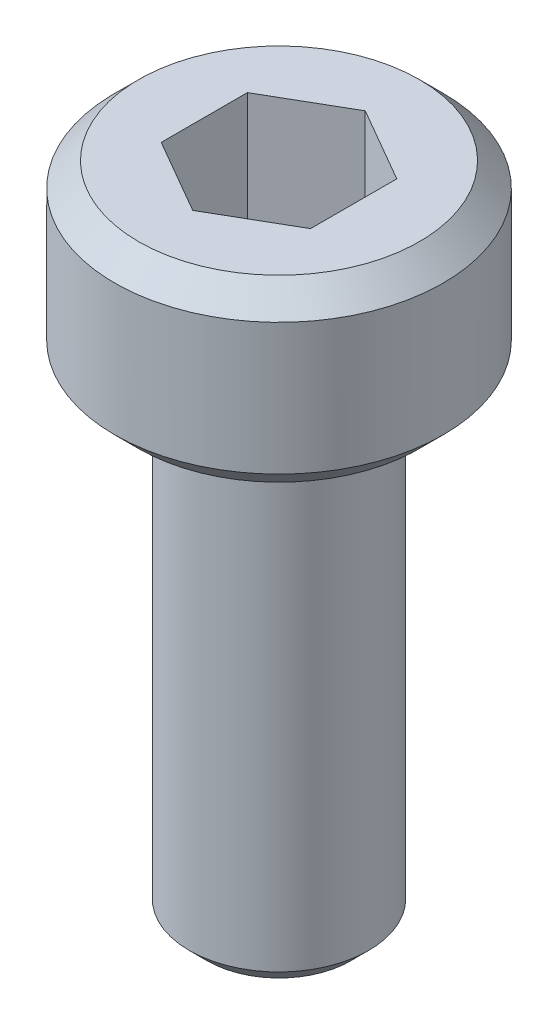
ISO-10303-21;
HEADER;
FILE_DESCRIPTION(('STEP AP214'),'2;1');
FILE_NAME('part.step','',(''),(''),'','','');
FILE_SCHEMA(('AUTOMOTIVE_DESIGN { 1 0 10303 214 1 1 1 1 }'));
ENDSEC;
DATA;
#1=APPLICATION_CONTEXT('core data for automotive mechanical design processes');
#2=APPLICATION_PROTOCOL_DEFINITION('international standard','automotive_design',2000,#1);
#3=PRODUCT_CONTEXT('',#1,'mechanical');
#4=PRODUCT('Part','Part','',(#3));
#5=PRODUCT_RELATED_PRODUCT_CATEGORY('part','',(#4));
#6=PRODUCT_DEFINITION_FORMATION('','',#4);
#7=PRODUCT_DEFINITION_CONTEXT('part definition',#1,'design');
#8=PRODUCT_DEFINITION('design','',#6,#7);
#9=PRODUCT_DEFINITION_SHAPE('','',#8);
#10=(LENGTH_UNIT() NAMED_UNIT(*) SI_UNIT(.MILLI.,.METRE.));
#11=(NAMED_UNIT(*) PLANE_ANGLE_UNIT() SI_UNIT($,.RADIAN.));
#12=(NAMED_UNIT(*) SI_UNIT($,.STERADIAN.) SOLID_ANGLE_UNIT());
#13=UNCERTAINTY_MEASURE_WITH_UNIT(LENGTH_MEASURE(1.E-05),#10,'distance_accuracy_value','');
#14=(GEOMETRIC_REPRESENTATION_CONTEXT(3) GLOBAL_UNCERTAINTY_ASSIGNED_CONTEXT((#13)) GLOBAL_UNIT_ASSIGNED_CONTEXT((#10,
#11,#12)) REPRESENTATION_CONTEXT('',''));
#15=CARTESIAN_POINT('',(0.,0.,0.));
#16=DIRECTION('',(0.,0.,1.));
#17=DIRECTION('',(1.,0.,0.));
#18=AXIS2_PLACEMENT_3D('',#15,#16,#17);
#19=CARTESIAN_POINT('',(0.,1.,-1.44337567297406));
#20=DIRECTION('',(-0.5,0.,-0.866025403784438));
#21=DIRECTION('',(-0.866025403784438,0.,0.5));
#22=AXIS2_PLACEMENT_3D('',#19,#20,#21);
#23=PLANE('',#22);
#24=DIRECTION('',(0.,1.,0.));
#25=VECTOR('',#24,1.);
#26=CARTESIAN_POINT('',(-1.25,1.,-0.721687836487031));
#27=LINE('',#26,#25);
#28=CARTESIAN_POINT('',(-1.25,3.,-0.721687836487031));
#29=VERTEX_POINT('',#28);
#30=CARTESIAN_POINT('',(-1.25,1.,-0.721687836487031));
#31=VERTEX_POINT('',#30);
#32=EDGE_CURVE('E83',#29,#31,#27,.F.);
#33=ORIENTED_EDGE('',*,*,#32,.T.);
#34=DIRECTION('',(-0.866025403784438,0.,0.5));
#35=VECTOR('',#34,1.);
#36=CARTESIAN_POINT('',(0.,1.,-1.44337567297406));
#37=LINE('',#36,#35);
#38=CARTESIAN_POINT('',(0.,1.,-1.44337567297406));
#39=VERTEX_POINT('',#38);
#40=EDGE_CURVE('E72',#39,#31,#37,.T.);
#41=ORIENTED_EDGE('',*,*,#40,.F.);
#42=DIRECTION('',(0.,1.,0.));
#43=VECTOR('',#42,1.);
#44=CARTESIAN_POINT('',(0.,1.,-1.44337567297406));
#45=LINE('',#44,#43);
#46=CARTESIAN_POINT('',(0.,3.,-1.44337567297406));
#47=VERTEX_POINT('',#46);
#48=EDGE_CURVE('E92',#39,#47,#45,.T.);
#49=ORIENTED_EDGE('',*,*,#48,.T.);
#50=DIRECTION('',(-0.866025403784438,0.,0.5));
#51=VECTOR('',#50,1.);
#52=CARTESIAN_POINT('',(0.,3.,-1.44337567297406));
#53=LINE('',#52,#51);
#54=EDGE_CURVE('E67',#29,#47,#53,.F.);
#55=ORIENTED_EDGE('',*,*,#54,.F.);
#56=EDGE_LOOP('',(#33,#41,#49,#55));
#57=FACE_BOUND('',#56,.T.);
#58=ADVANCED_FACE('F17',(#57),#23,.F.);
#59=CARTESIAN_POINT('',(-1.25,1.,-0.721687836487031));
#60=DIRECTION('',(-1.,0.,0.));
#61=DIRECTION('',(0.,0.,1.));
#62=AXIS2_PLACEMENT_3D('',#59,#60,#61);
#63=PLANE('',#62);
#64=DIRECTION('',(0.,1.,0.));
#65=VECTOR('',#64,1.);
#66=CARTESIAN_POINT('',(-1.25,1.,0.721687836487033));
#67=LINE('',#66,#65);
#68=CARTESIAN_POINT('',(-1.25,3.,0.721687836487033));
#69=VERTEX_POINT('',#68);
#70=CARTESIAN_POINT('',(-1.25,1.,0.721687836487033));
#71=VERTEX_POINT('',#70);
#72=EDGE_CURVE('E88',#69,#71,#67,.F.);
#73=ORIENTED_EDGE('',*,*,#72,.T.);
#74=DIRECTION('',(0.,0.,1.));
#75=VECTOR('',#74,1.);
#76=CARTESIAN_POINT('',(-1.25,1.,-0.721687836487031));
#77=LINE('',#76,#75);
#78=EDGE_CURVE('E76',#31,#71,#77,.T.);
#79=ORIENTED_EDGE('',*,*,#78,.F.);
#80=ORIENTED_EDGE('',*,*,#32,.F.);
#81=DIRECTION('',(0.,0.,1.));
#82=VECTOR('',#81,1.);
#83=CARTESIAN_POINT('',(-1.25,3.,-0.721687836487031));
#84=LINE('',#83,#82);
#85=EDGE_CURVE('E90',#69,#29,#84,.F.);
#86=ORIENTED_EDGE('',*,*,#85,.F.);
#87=EDGE_LOOP('',(#73,#79,#80,#86));
#88=FACE_BOUND('',#87,.T.);
#89=ADVANCED_FACE('F86',(#88),#63,.F.);
#90=CARTESIAN_POINT('',(1.25,1.,-0.721687836487032));
#91=DIRECTION('',(0.5,0.,-0.866025403784439));
#92=DIRECTION('',(-0.866025403784439,0.,-0.5));
#93=AXIS2_PLACEMENT_3D('',#90,#91,#92);
#94=PLANE('',#93);
#95=ORIENTED_EDGE('',*,*,#48,.F.);
#96=DIRECTION('',(-0.866025403784439,0.,-0.5));
#97=VECTOR('',#96,1.);
#98=CARTESIAN_POINT('',(1.25,1.,-0.721687836487032));
#99=LINE('',#98,#97);
#100=CARTESIAN_POINT('',(1.25,1.,-0.721687836487032));
#101=VERTEX_POINT('',#100);
#102=EDGE_CURVE('E79',#101,#39,#99,.T.);
#103=ORIENTED_EDGE('',*,*,#102,.F.);
#104=DIRECTION('',(0.,1.,0.));
#105=VECTOR('',#104,1.);
#106=CARTESIAN_POINT('',(1.25,1.,-0.721687836487032));
#107=LINE('',#106,#105);
#108=CARTESIAN_POINT('',(1.25,3.,-0.721687836487032));
#109=VERTEX_POINT('',#108);
#110=EDGE_CURVE('E122',#101,#109,#107,.T.);
#111=ORIENTED_EDGE('',*,*,#110,.T.);
#112=DIRECTION('',(-0.866025403784439,0.,-0.5));
#113=VECTOR('',#112,1.);
#114=CARTESIAN_POINT('',(1.25,3.,-0.721687836487032));
#115=LINE('',#114,#113);
#116=EDGE_CURVE('E134',#47,#109,#115,.F.);
#117=ORIENTED_EDGE('',*,*,#116,.F.);
#118=EDGE_LOOP('',(#95,#103,#111,#117));
#119=FACE_BOUND('',#118,.T.);
#120=ADVANCED_FACE('F137',(#119),#94,.F.);
#121=CARTESIAN_POINT('',(-1.25,1.,0.721687836487033));
#122=DIRECTION('',(-0.499999999999999,0.,0.866025403784439));
#123=DIRECTION('',(0.866025403784439,0.,0.499999999999999));
#124=AXIS2_PLACEMENT_3D('',#121,#122,#123);
#125=PLANE('',#124);
#126=DIRECTION('',(0.,1.,0.));
#127=VECTOR('',#126,1.);
#128=CARTESIAN_POINT('',(0.,1.,1.44337567297406));
#129=LINE('',#128,#127);
#130=CARTESIAN_POINT('',(0.,3.,1.44337567297406));
#131=VERTEX_POINT('',#130);
#132=CARTESIAN_POINT('',(0.,1.,1.44337567297406));
#133=VERTEX_POINT('',#132);
#134=EDGE_CURVE('E119',#131,#133,#129,.F.);
#135=ORIENTED_EDGE('',*,*,#134,.T.);
#136=DIRECTION('',(0.866025403784439,0.,0.499999999999999));
#137=VECTOR('',#136,1.);
#138=CARTESIAN_POINT('',(-1.25,1.,0.721687836487033));
#139=LINE('',#138,#137);
#140=EDGE_CURVE('E128',#71,#133,#139,.T.);
#141=ORIENTED_EDGE('',*,*,#140,.F.);
#142=ORIENTED_EDGE('',*,*,#72,.F.);
#143=DIRECTION('',(0.866025403784439,0.,0.499999999999999));
#144=VECTOR('',#143,1.);
#145=CARTESIAN_POINT('',(-1.25,3.,0.721687836487033));
#146=LINE('',#145,#144);
#147=EDGE_CURVE('E130',#131,#69,#146,.F.);
#148=ORIENTED_EDGE('',*,*,#147,.F.);
#149=EDGE_LOOP('',(#135,#141,#142,#148));
#150=FACE_BOUND('',#149,.T.);
#151=ADVANCED_FACE('F144',(#150),#125,.F.);
#152=CARTESIAN_POINT('',(1.25,1.,2.1650635094611));
#153=DIRECTION('',(0.,1.,0.));
#154=DIRECTION('',(0.,0.,1.));
#155=AXIS2_PLACEMENT_3D('',#152,#153,#154);
#156=PLANE('',#155);
#157=ORIENTED_EDGE('',*,*,#40,.T.);
#158=ORIENTED_EDGE('',*,*,#78,.T.);
#159=ORIENTED_EDGE('',*,*,#140,.T.);
#160=DIRECTION('',(0.866025403784438,0.,-0.5));
#161=VECTOR('',#160,1.);
#162=CARTESIAN_POINT('',(0.,1.,1.44337567297406));
#163=LINE('',#162,#161);
#164=CARTESIAN_POINT('',(1.25,1.,0.721687836487031));
#165=VERTEX_POINT('',#164);
#166=EDGE_CURVE('E117',#133,#165,#163,.T.);
#167=ORIENTED_EDGE('',*,*,#166,.T.);
#168=DIRECTION('',(0.,0.,-1.));
#169=VECTOR('',#168,1.);
#170=CARTESIAN_POINT('',(1.25,1.,0.721687836487031));
#171=LINE('',#170,#169);
#172=EDGE_CURVE('E125',#165,#101,#171,.T.);
#173=ORIENTED_EDGE('',*,*,#172,.T.);
#174=ORIENTED_EDGE('',*,*,#102,.T.);
#175=EDGE_LOOP('',(#157,#158,#159,#167,#173,#174));
#176=FACE_BOUND('',#175,.T.);
#177=ADVANCED_FACE('F73',(#176),#156,.T.);
#178=CARTESIAN_POINT('',(1.25,1.,0.721687836487031));
#179=DIRECTION('',(1.,0.,0.));
#180=DIRECTION('',(0.,0.,-1.));
#181=AXIS2_PLACEMENT_3D('',#178,#179,#180);
#182=PLANE('',#181);
#183=ORIENTED_EDGE('',*,*,#110,.F.);
#184=ORIENTED_EDGE('',*,*,#172,.F.);
#185=DIRECTION('',(0.,1.,0.));
#186=VECTOR('',#185,1.);
#187=CARTESIAN_POINT('',(1.25,1.,0.721687836487031));
#188=LINE('',#187,#186);
#189=CARTESIAN_POINT('',(1.25,3.,0.721687836487031));
#190=VERTEX_POINT('',#189);
#191=EDGE_CURVE('E115',#165,#190,#188,.T.);
#192=ORIENTED_EDGE('',*,*,#191,.T.);
#193=DIRECTION('',(0.,0.,-1.));
#194=VECTOR('',#193,1.);
#195=CARTESIAN_POINT('',(1.25,3.,0.721687836487031));
#196=LINE('',#195,#194);
#197=EDGE_CURVE('E35',#109,#190,#196,.F.);
#198=ORIENTED_EDGE('',*,*,#197,.F.);
#199=EDGE_LOOP('',(#183,#184,#192,#198));
#200=FACE_BOUND('',#199,.T.);
#201=ADVANCED_FACE('F151',(#200),#182,.F.);
#202=CARTESIAN_POINT('',(0.,1.,1.44337567297406));
#203=DIRECTION('',(0.5,0.,0.866025403784438));
#204=DIRECTION('',(0.866025403784438,0.,-0.5));
#205=AXIS2_PLACEMENT_3D('',#202,#203,#204);
#206=PLANE('',#205);
#207=ORIENTED_EDGE('',*,*,#191,.F.);
#208=ORIENTED_EDGE('',*,*,#166,.F.);
#209=ORIENTED_EDGE('',*,*,#134,.F.);
#210=DIRECTION('',(-0.866025403784438,0.,0.500000000000001));
#211=VECTOR('',#210,1.);
#212=CARTESIAN_POINT('',(1.25,3.,0.721687836487031));
#213=LINE('',#212,#211);
#214=EDGE_CURVE('E113',#190,#131,#213,.T.);
#215=ORIENTED_EDGE('',*,*,#214,.F.);
#216=EDGE_LOOP('',(#207,#208,#209,#215));
#217=FACE_BOUND('',#216,.T.);
#218=ADVANCED_FACE('F149',(#217),#206,.F.);
#219=CARTESIAN_POINT('',(0.,3.,0.));
#220=DIRECTION('',(0.,1.,0.));
#221=DIRECTION('',(0.,0.,1.));
#222=AXIS2_PLACEMENT_3D('',#219,#220,#221);
#223=PLANE('',#222);
#224=ORIENTED_EDGE('',*,*,#197,.T.);
#225=ORIENTED_EDGE('',*,*,#214,.T.);
#226=ORIENTED_EDGE('',*,*,#147,.T.);
#227=ORIENTED_EDGE('',*,*,#85,.T.);
#228=ORIENTED_EDGE('',*,*,#54,.T.);
#229=ORIENTED_EDGE('',*,*,#116,.T.);
#230=EDGE_LOOP('',(#224,#225,#226,#227,#228,#229));
#231=FACE_BOUND('',#230,.T.);
#232=CARTESIAN_POINT('',(0.,2.9999999999859,0.));
#233=DIRECTION('',(0.,-1.,0.));
#234=DIRECTION('',(0.,0.,-1.));
#235=AXIS2_PLACEMENT_3D('',#232,#233,#234);
#236=CIRCLE('',#235,2.35000000003538);
#237=CARTESIAN_POINT('',(0.,2.9999999999859,-2.35000000003538));
#238=VERTEX_POINT('',#237);
#239=EDGE_CURVE('E20',#238,#238,#236,.T.);
#240=ORIENTED_EDGE('',*,*,#239,.F.);
#241=EDGE_LOOP('',(#240));
#242=FACE_BOUND('',#241,.T.);
#243=ADVANCED_FACE('F139',(#231,#242),#223,.T.);
#244=CARTESIAN_POINT('',(0.,2.59999999991578,0.));
#245=DIRECTION('',(0.,-1.,0.));
#246=DIRECTION('',(0.,0.,-1.));
#247=AXIS2_PLACEMENT_3D('',#244,#245,#246);
#248=CONICAL_SURFACE('',#247,2.7500000001055,0.785398163397448);
#249=ORIENTED_EDGE('',*,*,#239,.T.);
#250=EDGE_LOOP('',(#249));
#251=FACE_BOUND('',#250,.T.);
#252=CARTESIAN_POINT('',(0.,2.6,0.));
#253=DIRECTION('',(0.,-1.,0.));
#254=DIRECTION('',(0.,0.,-1.));
#255=AXIS2_PLACEMENT_3D('',#252,#253,#254);
#256=CIRCLE('',#255,2.75);
#257=CARTESIAN_POINT('',(0.,2.6,-2.75));
#258=VERTEX_POINT('',#257);
#259=EDGE_CURVE('E105',#258,#258,#256,.T.);
#260=ORIENTED_EDGE('',*,*,#259,.F.);
#261=EDGE_LOOP('',(#260));
#262=FACE_BOUND('',#261,.T.);
#263=ADVANCED_FACE('F188',(#251,#262),#248,.T.);
#264=CARTESIAN_POINT('',(0.,3.,0.));
#265=DIRECTION('',(0.,-1.,0.));
#266=DIRECTION('',(0.,0.,-1.));
#267=AXIS2_PLACEMENT_3D('',#264,#265,#266);
#268=CYLINDRICAL_SURFACE('',#267,2.75);
#269=ORIENTED_EDGE('',*,*,#259,.T.);
#270=EDGE_LOOP('',(#269));
#271=FACE_BOUND('',#270,.T.);
#272=CARTESIAN_POINT('',(0.,0.400000000013279,0.));
#273=DIRECTION('',(0.,1.,0.));
#274=DIRECTION('',(0.,0.,1.));
#275=AXIS2_PLACEMENT_3D('',#272,#273,#274);
#276=CIRCLE('',#275,2.74999999999181);
#277=CARTESIAN_POINT('',(0.,0.400000000013279,2.74999999999181));
#278=VERTEX_POINT('',#277);
#279=EDGE_CURVE('E101',#278,#278,#276,.F.);
#280=ORIENTED_EDGE('',*,*,#279,.F.);
#281=EDGE_LOOP('',(#280));
#282=FACE_BOUND('',#281,.T.);
#283=ADVANCED_FACE('F184',(#271,#282),#268,.T.);
#284=CARTESIAN_POINT('',(0.,-8.,0.));
#285=DIRECTION('',(0.,1.,0.));
#286=DIRECTION('',(0.,0.,1.));
#287=AXIS2_PLACEMENT_3D('',#284,#285,#286);
#288=PLANE('',#287);
#289=CARTESIAN_POINT('',(0.,-7.99999999998136,0.));
#290=DIRECTION('',(0.,1.,0.));
#291=DIRECTION('',(0.,0.,1.));
#292=AXIS2_PLACEMENT_3D('',#289,#290,#291);
#293=CIRCLE('',#292,1.20000000009668);
#294=CARTESIAN_POINT('',(0.,-7.99999999998136,1.20000000009668));
#295=VERTEX_POINT('',#294);
#296=EDGE_CURVE('E99',#295,#295,#293,.T.);
#297=ORIENTED_EDGE('',*,*,#296,.F.);
#298=EDGE_LOOP('',(#297));
#299=FACE_BOUND('',#298,.T.);
#300=ADVANCED_FACE('F180',(#299),#288,.F.);
#301=CARTESIAN_POINT('',(0.,0.400000000013279,0.));
#302=DIRECTION('',(0.,1.,0.));
#303=DIRECTION('',(0.,0.,1.));
#304=AXIS2_PLACEMENT_3D('',#301,#302,#303);
#305=CONICAL_SURFACE('',#304,2.74999999999181,0.785398163397448);
#306=CARTESIAN_POINT('',(0.,0.,0.));
#307=DIRECTION('',(0.,1.,0.));
#308=DIRECTION('',(0.,0.,1.));
#309=AXIS2_PLACEMENT_3D('',#306,#307,#308);
#310=CIRCLE('',#309,2.34999999997854);
#311=CARTESIAN_POINT('',(0.,0.,2.34999999997854));
#312=VERTEX_POINT('',#311);
#313=EDGE_CURVE('E97',#312,#312,#310,.T.);
#314=ORIENTED_EDGE('',*,*,#313,.T.);
#315=EDGE_LOOP('',(#314));
#316=FACE_BOUND('',#315,.T.);
#317=ORIENTED_EDGE('',*,*,#279,.T.);
#318=EDGE_LOOP('',(#317));
#319=FACE_BOUND('',#318,.T.);
#320=ADVANCED_FACE('F176',(#316,#319),#305,.T.);
#321=CARTESIAN_POINT('',(0.,-7.7000000001135,0.));
#322=DIRECTION('',(0.,1.,0.));
#323=DIRECTION('',(0.,0.,1.));
#324=AXIS2_PLACEMENT_3D('',#321,#322,#323);
#325=CONICAL_SURFACE('',#324,1.49999999996453,0.785398163397448);
#326=CARTESIAN_POINT('',(0.,-7.7,0.));
#327=DIRECTION('',(0.,1.,0.));
#328=DIRECTION('',(0.,0.,1.));
#329=AXIS2_PLACEMENT_3D('',#326,#327,#328);
#330=CIRCLE('',#329,1.5);
#331=CARTESIAN_POINT('',(0.,-7.7,1.5));
#332=VERTEX_POINT('',#331);
#333=EDGE_CURVE('E26',#332,#332,#330,.T.);
#334=ORIENTED_EDGE('',*,*,#333,.F.);
#335=EDGE_LOOP('',(#334));
#336=FACE_BOUND('',#335,.T.);
#337=ORIENTED_EDGE('',*,*,#296,.T.);
#338=EDGE_LOOP('',(#337));
#339=FACE_BOUND('',#338,.T.);
#340=ADVANCED_FACE('F169',(#336,#339),#325,.T.);
#341=CARTESIAN_POINT('',(0.,0.,0.));
#342=DIRECTION('',(0.,1.,0.));
#343=DIRECTION('',(0.,0.,1.));
#344=AXIS2_PLACEMENT_3D('',#341,#342,#343);
#345=PLANE('',#344);
#346=CARTESIAN_POINT('',(0.,0.,0.));
#347=DIRECTION('',(0.,1.,0.));
#348=DIRECTION('',(0.,0.,1.));
#349=AXIS2_PLACEMENT_3D('',#346,#347,#348);
#350=CIRCLE('',#349,1.5);
#351=CARTESIAN_POINT('',(0.,0.,1.5));
#352=VERTEX_POINT('',#351);
#353=EDGE_CURVE('E11',#352,#352,#350,.F.);
#354=ORIENTED_EDGE('',*,*,#353,.F.);
#355=EDGE_LOOP('',(#354));
#356=FACE_BOUND('',#355,.T.);
#357=ORIENTED_EDGE('',*,*,#313,.F.);
#358=EDGE_LOOP('',(#357));
#359=FACE_BOUND('',#358,.T.);
#360=ADVANCED_FACE('F163',(#356,#359),#345,.F.);
#361=CARTESIAN_POINT('',(0.,-8.,0.));
#362=DIRECTION('',(0.,1.,0.));
#363=DIRECTION('',(0.,0.,1.));
#364=AXIS2_PLACEMENT_3D('',#361,#362,#363);
#365=CYLINDRICAL_SURFACE('',#364,1.5);
#366=ORIENTED_EDGE('',*,*,#353,.T.);
#367=EDGE_LOOP('',(#366));
#368=FACE_BOUND('',#367,.T.);
#369=ORIENTED_EDGE('',*,*,#333,.T.);
#370=EDGE_LOOP('',(#369));
#371=FACE_BOUND('',#370,.T.);
#372=ADVANCED_FACE('F161',(#368,#371),#365,.T.);
#373=CLOSED_SHELL('',(#58,#89,#120,#151,#177,#201,#218,#243,#263,#283,#300,#320,#340,#360,#372));
#374=MANIFOLD_SOLID_BREP('B1',#373);
#375=ADVANCED_BREP_SHAPE_REPRESENTATION('',(#18,#374),#14);
#376=SHAPE_DEFINITION_REPRESENTATION(#9,#375);
ENDSEC;
END-ISO-10303-21;
